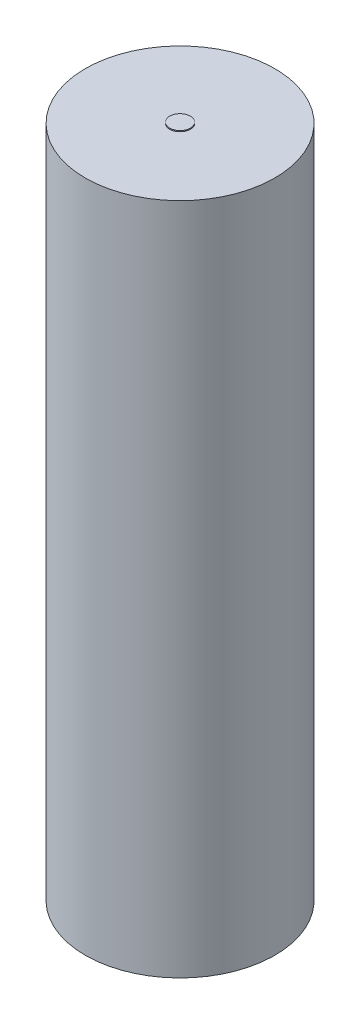
ISO-10303-21;
HEADER;
FILE_DESCRIPTION(('STEP AP214'),'2;1');
FILE_NAME('part.step','',(''),(''),'','','');
FILE_SCHEMA(('AUTOMOTIVE_DESIGN { 1 0 10303 214 1 1 1 1 }'));
ENDSEC;
DATA;
#1=APPLICATION_CONTEXT('core data for automotive mechanical design processes');
#2=APPLICATION_PROTOCOL_DEFINITION('international standard','automotive_design',2000,#1);
#3=PRODUCT_CONTEXT('',#1,'mechanical');
#4=PRODUCT('Part','Part','',(#3));
#5=PRODUCT_RELATED_PRODUCT_CATEGORY('part','',(#4));
#6=PRODUCT_DEFINITION_FORMATION('','',#4);
#7=PRODUCT_DEFINITION_CONTEXT('part definition',#1,'design');
#8=PRODUCT_DEFINITION('design','',#6,#7);
#9=PRODUCT_DEFINITION_SHAPE('','',#8);
#10=(LENGTH_UNIT() NAMED_UNIT(*) SI_UNIT(.MILLI.,.METRE.));
#11=(NAMED_UNIT(*) PLANE_ANGLE_UNIT() SI_UNIT($,.RADIAN.));
#12=(NAMED_UNIT(*) SI_UNIT($,.STERADIAN.) SOLID_ANGLE_UNIT());
#13=UNCERTAINTY_MEASURE_WITH_UNIT(LENGTH_MEASURE(1.E-05),#10,'distance_accuracy_value','');
#14=(GEOMETRIC_REPRESENTATION_CONTEXT(3) GLOBAL_UNCERTAINTY_ASSIGNED_CONTEXT((#13)) GLOBAL_UNIT_ASSIGNED_CONTEXT((#10,
#11,#12)) REPRESENTATION_CONTEXT('',''));
#15=CARTESIAN_POINT('',(0.,0.,0.));
#16=DIRECTION('',(0.,0.,1.));
#17=DIRECTION('',(1.,0.,0.));
#18=AXIS2_PLACEMENT_3D('',#15,#16,#17);
#19=CARTESIAN_POINT('',(0.,-65.,0.));
#20=DIRECTION('',(0.,1.,0.));
#21=DIRECTION('',(0.,0.,1.));
#22=AXIS2_PLACEMENT_3D('',#19,#20,#21);
#23=CYLINDRICAL_SURFACE('',#22,9.15);
#24=CARTESIAN_POINT('',(0.,-65.,0.));
#25=DIRECTION('',(0.,1.,0.));
#26=DIRECTION('',(0.,0.,1.));
#27=AXIS2_PLACEMENT_3D('',#24,#25,#26);
#28=CIRCLE('',#27,9.15);
#29=CARTESIAN_POINT('',(0.,-65.,9.15));
#30=VERTEX_POINT('',#29);
#31=EDGE_CURVE('E40',#30,#30,#28,.T.);
#32=ORIENTED_EDGE('',*,*,#31,.T.);
#33=EDGE_LOOP('',(#32));
#34=FACE_BOUND('',#33,.T.);
#35=CARTESIAN_POINT('',(0.,0.,0.));
#36=DIRECTION('',(0.,1.,0.));
#37=DIRECTION('',(0.,0.,1.));
#38=AXIS2_PLACEMENT_3D('',#35,#36,#37);
#39=CIRCLE('',#38,9.15);
#40=CARTESIAN_POINT('',(0.,0.,9.15));
#41=VERTEX_POINT('',#40);
#42=EDGE_CURVE('E44',#41,#41,#39,.T.);
#43=ORIENTED_EDGE('',*,*,#42,.F.);
#44=EDGE_LOOP('',(#43));
#45=FACE_BOUND('',#44,.T.);
#46=ADVANCED_FACE('F34',(#34,#45),#23,.T.);
#47=CARTESIAN_POINT('',(0.,-65.,0.));
#48=DIRECTION('',(0.,1.,0.));
#49=DIRECTION('',(0.,0.,1.));
#50=AXIS2_PLACEMENT_3D('',#47,#48,#49);
#51=PLANE('',#50);
#52=CARTESIAN_POINT('',(0.,-65.,0.));
#53=DIRECTION('',(0.,1.,0.));
#54=DIRECTION('',(0.,0.,1.));
#55=AXIS2_PLACEMENT_3D('',#52,#53,#54);
#56=CIRCLE('',#55,1.);
#57=CARTESIAN_POINT('',(0.,-65.,1.));
#58=VERTEX_POINT('',#57);
#59=EDGE_CURVE('E10',#58,#58,#56,.F.);
#60=ORIENTED_EDGE('',*,*,#59,.F.);
#61=EDGE_LOOP('',(#60));
#62=FACE_BOUND('',#61,.T.);
#63=ORIENTED_EDGE('',*,*,#31,.F.);
#64=EDGE_LOOP('',(#63));
#65=FACE_BOUND('',#64,.T.);
#66=ADVANCED_FACE('F75',(#62,#65),#51,.F.);
#67=CARTESIAN_POINT('',(0.,0.,0.));
#68=DIRECTION('',(0.,1.,0.));
#69=DIRECTION('',(0.,0.,1.));
#70=AXIS2_PLACEMENT_3D('',#67,#68,#69);
#71=PLANE('',#70);
#72=CARTESIAN_POINT('',(0.,0.,0.));
#73=DIRECTION('',(0.,1.,0.));
#74=DIRECTION('',(0.,0.,1.));
#75=AXIS2_PLACEMENT_3D('',#72,#73,#74);
#76=CIRCLE('',#75,1.);
#77=CARTESIAN_POINT('',(0.,0.,1.));
#78=VERTEX_POINT('',#77);
#79=EDGE_CURVE('E51',#78,#78,#76,.T.);
#80=ORIENTED_EDGE('',*,*,#79,.F.);
#81=EDGE_LOOP('',(#80));
#82=FACE_BOUND('',#81,.T.);
#83=ORIENTED_EDGE('',*,*,#42,.T.);
#84=EDGE_LOOP('',(#83));
#85=FACE_BOUND('',#84,.T.);
#86=ADVANCED_FACE('F79',(#82,#85),#71,.T.);
#87=CARTESIAN_POINT('',(0.,0.1,0.));
#88=DIRECTION('',(0.,-1.,0.));
#89=DIRECTION('',(0.,0.,-1.));
#90=AXIS2_PLACEMENT_3D('',#87,#88,#89);
#91=CYLINDRICAL_SURFACE('',#90,1.);
#92=CARTESIAN_POINT('',(0.,0.1,0.));
#93=DIRECTION('',(0.,1.,0.));
#94=DIRECTION('',(0.,0.,1.));
#95=AXIS2_PLACEMENT_3D('',#92,#93,#94);
#96=CIRCLE('',#95,1.);
#97=CARTESIAN_POINT('',(0.,0.1,1.));
#98=VERTEX_POINT('',#97);
#99=EDGE_CURVE('E49',#98,#98,#96,.T.);
#100=ORIENTED_EDGE('',*,*,#99,.F.);
#101=EDGE_LOOP('',(#100));
#102=FACE_BOUND('',#101,.T.);
#103=ORIENTED_EDGE('',*,*,#79,.T.);
#104=EDGE_LOOP('',(#103));
#105=FACE_BOUND('',#104,.T.);
#106=ADVANCED_FACE('F71',(#102,#105),#91,.T.);
#107=CARTESIAN_POINT('',(0.,0.1,0.));
#108=DIRECTION('',(0.,1.,0.));
#109=DIRECTION('',(0.,0.,1.));
#110=AXIS2_PLACEMENT_3D('',#107,#108,#109);
#111=PLANE('',#110);
#112=ORIENTED_EDGE('',*,*,#99,.T.);
#113=EDGE_LOOP('',(#112));
#114=FACE_BOUND('',#113,.T.);
#115=ADVANCED_FACE('F64',(#114),#111,.T.);
#116=CARTESIAN_POINT('',(0.,-65.1,0.));
#117=DIRECTION('',(0.,1.,0.));
#118=DIRECTION('',(0.,0.,1.));
#119=AXIS2_PLACEMENT_3D('',#116,#117,#118);
#120=CYLINDRICAL_SURFACE('',#119,1.);
#121=CARTESIAN_POINT('',(0.,-65.1,0.));
#122=DIRECTION('',(0.,-1.,0.));
#123=DIRECTION('',(0.,0.,-1.));
#124=AXIS2_PLACEMENT_3D('',#121,#122,#123);
#125=CIRCLE('',#124,1.);
#126=CARTESIAN_POINT('',(0.,-65.1,-1.));
#127=VERTEX_POINT('',#126);
#128=EDGE_CURVE('E54',#127,#127,#125,.T.);
#129=ORIENTED_EDGE('',*,*,#128,.F.);
#130=EDGE_LOOP('',(#129));
#131=FACE_BOUND('',#130,.T.);
#132=ORIENTED_EDGE('',*,*,#59,.T.);
#133=EDGE_LOOP('',(#132));
#134=FACE_BOUND('',#133,.T.);
#135=ADVANCED_FACE('F62',(#131,#134),#120,.T.);
#136=CARTESIAN_POINT('',(0.,-65.1,0.));
#137=DIRECTION('',(0.,-1.,0.));
#138=DIRECTION('',(0.,0.,-1.));
#139=AXIS2_PLACEMENT_3D('',#136,#137,#138);
#140=PLANE('',#139);
#141=ORIENTED_EDGE('',*,*,#128,.T.);
#142=EDGE_LOOP('',(#141));
#143=FACE_BOUND('',#142,.T.);
#144=ADVANCED_FACE('F60',(#143),#140,.T.);
#145=CLOSED_SHELL('',(#46,#66,#86,#106,#115,#135,#144));
#146=MANIFOLD_SOLID_BREP('B2',#145);
#147=ADVANCED_BREP_SHAPE_REPRESENTATION('',(#18,#146),#14);
#148=SHAPE_DEFINITION_REPRESENTATION(#9,#147);
ENDSEC;
END-ISO-10303-21;
